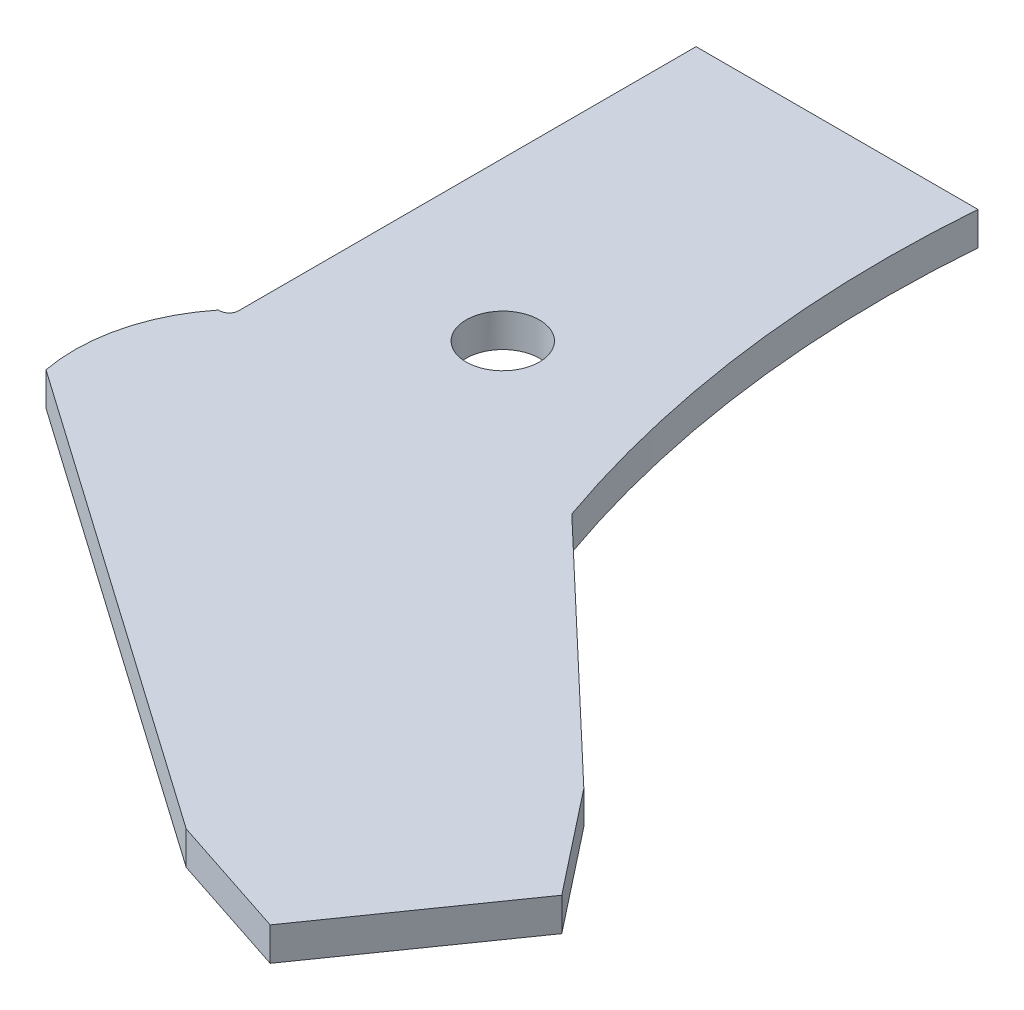
ISO-10303-21;
HEADER;
FILE_DESCRIPTION(('STEP AP214'),'2;1');
FILE_NAME('part.step','',(''),(''),'','','');
FILE_SCHEMA(('AUTOMOTIVE_DESIGN { 1 0 10303 214 1 1 1 1 }'));
ENDSEC;
DATA;
#1=APPLICATION_CONTEXT('core data for automotive mechanical design processes');
#2=APPLICATION_PROTOCOL_DEFINITION('international standard','automotive_design',2000,#1);
#3=PRODUCT_CONTEXT('',#1,'mechanical');
#4=PRODUCT('Part','Part','',(#3));
#5=PRODUCT_RELATED_PRODUCT_CATEGORY('part','',(#4));
#6=PRODUCT_DEFINITION_FORMATION('','',#4);
#7=PRODUCT_DEFINITION_CONTEXT('part definition',#1,'design');
#8=PRODUCT_DEFINITION('design','',#6,#7);
#9=PRODUCT_DEFINITION_SHAPE('','',#8);
#10=(LENGTH_UNIT() NAMED_UNIT(*) SI_UNIT(.MILLI.,.METRE.));
#11=(NAMED_UNIT(*) PLANE_ANGLE_UNIT() SI_UNIT($,.RADIAN.));
#12=(NAMED_UNIT(*) SI_UNIT($,.STERADIAN.) SOLID_ANGLE_UNIT());
#13=UNCERTAINTY_MEASURE_WITH_UNIT(LENGTH_MEASURE(1.E-05),#10,'distance_accuracy_value','');
#14=(GEOMETRIC_REPRESENTATION_CONTEXT(3) GLOBAL_UNCERTAINTY_ASSIGNED_CONTEXT((#13)) GLOBAL_UNIT_ASSIGNED_CONTEXT((#10,
#11,#12)) REPRESENTATION_CONTEXT('',''));
#15=CARTESIAN_POINT('',(0.,0.,0.));
#16=DIRECTION('',(0.,0.,1.));
#17=DIRECTION('',(1.,0.,0.));
#18=AXIS2_PLACEMENT_3D('',#15,#16,#17);
#19=CARTESIAN_POINT('',(-50.2046875,11.1125,152.5984375));
#20=DIRECTION('',(0.,-1.,0.));
#21=DIRECTION('',(0.,0.,-1.));
#22=AXIS2_PLACEMENT_3D('',#19,#20,#21);
#23=PLANE('',#22);
#24=CARTESIAN_POINT('',(5.75468750000002,11.1125,117.2765625));
#25=DIRECTION('',(0.,1.,0.));
#26=DIRECTION('',(0.,0.,1.));
#27=AXIS2_PLACEMENT_3D('',#24,#25,#26);
#28=CIRCLE('',#27,12.20390625);
#29=CARTESIAN_POINT('',(5.75468750000002,11.1125,129.48046875));
#30=VERTEX_POINT('',#29);
#31=EDGE_CURVE('E249',#30,#30,#28,.T.);
#32=ORIENTED_EDGE('',*,*,#31,.F.);
#33=EDGE_LOOP('',(#32));
#34=FACE_BOUND('',#33,.T.);
#35=DIRECTION('',(0.,0.,1.));
#36=VECTOR('',#35,1.);
#37=CARTESIAN_POINT('',(-47.0296875,11.1125,0.));
#38=LINE('',#37,#36);
#39=CARTESIAN_POINT('',(-47.0296875,11.1125,0.));
#40=VERTEX_POINT('',#39);
#41=CARTESIAN_POINT('',(-47.0296875,11.1125,152.5984375));
#42=VERTEX_POINT('',#41);
#43=EDGE_CURVE('E167',#40,#42,#38,.T.);
#44=ORIENTED_EDGE('',*,*,#43,.T.);
#45=CARTESIAN_POINT('',(-50.2046875,11.1125,152.5984375));
#46=DIRECTION('',(0.,-1.,0.));
#47=DIRECTION('',(0.,0.,-1.));
#48=AXIS2_PLACEMENT_3D('',#45,#46,#47);
#49=CIRCLE('',#48,3.17499999999999);
#50=CARTESIAN_POINT('',(-50.2046875,11.1125,155.7734375));
#51=VERTEX_POINT('',#50);
#52=EDGE_CURVE('E101',#42,#51,#49,.T.);
#53=ORIENTED_EDGE('',*,*,#52,.T.);
#54=DIRECTION('',(-1.,0.,0.));
#55=VECTOR('',#54,1.);
#56=CARTESIAN_POINT('',(-50.6015625,11.1125,155.7734375));
#57=LINE('',#56,#55);
#58=CARTESIAN_POINT('',(-50.6015625,11.1125,155.7734375));
#59=VERTEX_POINT('',#58);
#60=EDGE_CURVE('E191',#51,#59,#57,.T.);
#61=ORIENTED_EDGE('',*,*,#60,.T.);
#62=CARTESIAN_POINT('',(-6.35000000000003,11.1125,191.29375));
#63=DIRECTION('',(0.,1.,0.));
#64=DIRECTION('',(0.,0.,-1.));
#65=AXIS2_PLACEMENT_3D('',#62,#63,#64);
#66=CIRCLE('',#65,56.7441043967482);
#67=CARTESIAN_POINT('',(-62.1109375,11.1125,201.8109375));
#68=VERTEX_POINT('',#67);
#69=EDGE_CURVE('E209',#59,#68,#66,.T.);
#70=ORIENTED_EDGE('',*,*,#69,.T.);
#71=DIRECTION('',(0.819152044288994,0.,0.573576436351042));
#72=VECTOR('',#71,1.);
#73=CARTESIAN_POINT('',(-62.1109375,11.1125,201.8109375));
#74=LINE('',#73,#72);
#75=CARTESIAN_POINT('',(93.9375269370535,11.1125,311.077248624874));
#76=VERTEX_POINT('',#75);
#77=EDGE_CURVE('E206',#68,#76,#74,.T.);
#78=ORIENTED_EDGE('',*,*,#77,.T.);
#79=DIRECTION('',(0.949963175276949,0.,0.312361914480201));
#80=VECTOR('',#79,1.);
#81=CARTESIAN_POINT('',(93.9375269370535,11.1125,311.077248624874));
#82=LINE('',#81,#80);
#83=CARTESIAN_POINT('',(135.682650241894,11.1125,324.803661369147));
#84=VERTEX_POINT('',#83);
#85=EDGE_CURVE('E208',#76,#84,#82,.T.);
#86=ORIENTED_EDGE('',*,*,#85,.T.);
#87=DIRECTION('',(0.573576436351061,0.,-0.819152044288981));
#88=VECTOR('',#87,1.);
#89=CARTESIAN_POINT('',(135.682650241894,11.1125,324.803661369147));
#90=LINE('',#89,#88);
#91=CARTESIAN_POINT('',(175.746964321015,11.1125,267.585891075562));
#92=VERTEX_POINT('',#91);
#93=EDGE_CURVE('E211',#84,#92,#90,.T.);
#94=ORIENTED_EDGE('',*,*,#93,.T.);
#95=DIRECTION('',(-0.618430727413905,0.,-0.785839319066124));
#96=VECTOR('',#95,1.);
#97=CARTESIAN_POINT('',(175.746964321015,11.1125,267.585891075562));
#98=LINE('',#97,#96);
#99=CARTESIAN_POINT('',(148.570682499492,11.1125,233.053016406348));
#100=VERTEX_POINT('',#99);
#101=EDGE_CURVE('E128',#92,#100,#98,.T.);
#102=ORIENTED_EDGE('',*,*,#101,.T.);
#103=DIRECTION('',(-0.724802516724885,0.,-0.688956683507224));
#104=VECTOR('',#103,1.);
#105=CARTESIAN_POINT('',(67.2703125,11.1125,155.7734375));
#106=LINE('',#105,#104);
#107=CARTESIAN_POINT('',(67.2703124999999,11.1125,155.7734375));
#108=VERTEX_POINT('',#107);
#109=EDGE_CURVE('E123',#100,#108,#106,.T.);
#110=ORIENTED_EDGE('',*,*,#109,.T.);
#111=CARTESIAN_POINT('',(425.270240042471,11.1125,30.0545346935261));
#112=DIRECTION('',(0.,-1.,0.));
#113=DIRECTION('',(0.,0.,1.));
#114=AXIS2_PLACEMENT_3D('',#111,#112,#113);
#115=CIRCLE('',#114,379.432722156745);
#116=CARTESIAN_POINT('',(47.0296875,11.1125,0.));
#117=VERTEX_POINT('',#116);
#118=EDGE_CURVE('E126',#108,#117,#115,.T.);
#119=ORIENTED_EDGE('',*,*,#118,.T.);
#120=DIRECTION('',(-1.,0.,0.));
#121=VECTOR('',#120,1.);
#122=CARTESIAN_POINT('',(47.0296875,11.1125,0.));
#123=LINE('',#122,#121);
#124=EDGE_CURVE('E49',#117,#40,#123,.T.);
#125=ORIENTED_EDGE('',*,*,#124,.T.);
#126=EDGE_LOOP('',(#44,#53,#61,#70,#78,#86,#94,#102,#110,#119,#125));
#127=FACE_BOUND('',#126,.T.);
#128=ADVANCED_FACE('F32',(#34,#127),#23,.F.);
#129=CARTESIAN_POINT('',(-50.2046875,0.,152.5984375));
#130=DIRECTION('',(0.,-1.,0.));
#131=DIRECTION('',(0.,0.,-1.));
#132=AXIS2_PLACEMENT_3D('',#129,#130,#131);
#133=PLANE('',#132);
#134=CARTESIAN_POINT('',(5.75468750000002,0.,117.2765625));
#135=DIRECTION('',(0.,-1.,0.));
#136=DIRECTION('',(0.,0.,-1.));
#137=AXIS2_PLACEMENT_3D('',#134,#135,#136);
#138=CIRCLE('',#137,12.20390625);
#139=CARTESIAN_POINT('',(5.75468750000002,0.,105.07265625));
#140=VERTEX_POINT('',#139);
#141=EDGE_CURVE('E150',#140,#140,#138,.F.);
#142=ORIENTED_EDGE('',*,*,#141,.T.);
#143=EDGE_LOOP('',(#142));
#144=FACE_BOUND('',#143,.T.);
#145=DIRECTION('',(0.,0.,1.));
#146=VECTOR('',#145,1.);
#147=CARTESIAN_POINT('',(-47.0296875,0.,0.));
#148=LINE('',#147,#146);
#149=CARTESIAN_POINT('',(-47.0296875,0.,0.));
#150=VERTEX_POINT('',#149);
#151=CARTESIAN_POINT('',(-47.0296875,0.,152.5984375));
#152=VERTEX_POINT('',#151);
#153=EDGE_CURVE('E146',#150,#152,#148,.T.);
#154=ORIENTED_EDGE('',*,*,#153,.F.);
#155=DIRECTION('',(-1.,0.,0.));
#156=VECTOR('',#155,1.);
#157=CARTESIAN_POINT('',(47.0296875,0.,0.));
#158=LINE('',#157,#156);
#159=CARTESIAN_POINT('',(47.0296875,0.,0.));
#160=VERTEX_POINT('',#159);
#161=EDGE_CURVE('E93',#160,#150,#158,.T.);
#162=ORIENTED_EDGE('',*,*,#161,.F.);
#163=CARTESIAN_POINT('',(425.270240042471,0.,30.0545346935261));
#164=DIRECTION('',(0.,-1.,0.));
#165=DIRECTION('',(0.,0.,1.));
#166=AXIS2_PLACEMENT_3D('',#163,#164,#165);
#167=CIRCLE('',#166,379.432722156745);
#168=CARTESIAN_POINT('',(67.2703124999999,0.,155.7734375));
#169=VERTEX_POINT('',#168);
#170=EDGE_CURVE('E87',#169,#160,#167,.T.);
#171=ORIENTED_EDGE('',*,*,#170,.F.);
#172=DIRECTION('',(-0.724802516724885,0.,-0.688956683507224));
#173=VECTOR('',#172,1.);
#174=CARTESIAN_POINT('',(67.2703125,0.,155.7734375));
#175=LINE('',#174,#173);
#176=CARTESIAN_POINT('',(148.570682499492,0.,233.053016406348));
#177=VERTEX_POINT('',#176);
#178=EDGE_CURVE('E136',#177,#169,#175,.T.);
#179=ORIENTED_EDGE('',*,*,#178,.F.);
#180=DIRECTION('',(-0.618430727413905,0.,-0.785839319066124));
#181=VECTOR('',#180,1.);
#182=CARTESIAN_POINT('',(175.746964321015,0.,267.585891075562));
#183=LINE('',#182,#181);
#184=CARTESIAN_POINT('',(175.746964321015,0.,267.585891075562));
#185=VERTEX_POINT('',#184);
#186=EDGE_CURVE('E162',#185,#177,#183,.T.);
#187=ORIENTED_EDGE('',*,*,#186,.F.);
#188=DIRECTION('',(0.573576436351061,0.,-0.819152044288981));
#189=VECTOR('',#188,1.);
#190=CARTESIAN_POINT('',(135.682650241894,0.,324.803661369147));
#191=LINE('',#190,#189);
#192=CARTESIAN_POINT('',(135.682650241894,0.,324.803661369147));
#193=VERTEX_POINT('',#192);
#194=EDGE_CURVE('E160',#193,#185,#191,.T.);
#195=ORIENTED_EDGE('',*,*,#194,.F.);
#196=DIRECTION('',(0.949963175276949,0.,0.312361914480201));
#197=VECTOR('',#196,1.);
#198=CARTESIAN_POINT('',(93.9375269370535,0.,311.077248624874));
#199=LINE('',#198,#197);
#200=CARTESIAN_POINT('',(93.9375269370535,0.,311.077248624874));
#201=VERTEX_POINT('',#200);
#202=EDGE_CURVE('E158',#201,#193,#199,.T.);
#203=ORIENTED_EDGE('',*,*,#202,.F.);
#204=DIRECTION('',(0.819152044288994,0.,0.573576436351042));
#205=VECTOR('',#204,1.);
#206=CARTESIAN_POINT('',(-62.1109375,0.,201.8109375));
#207=LINE('',#206,#205);
#208=CARTESIAN_POINT('',(-62.1109375,0.,201.8109375));
#209=VERTEX_POINT('',#208);
#210=EDGE_CURVE('E156',#209,#201,#207,.T.);
#211=ORIENTED_EDGE('',*,*,#210,.F.);
#212=CARTESIAN_POINT('',(-6.35000000000003,0.,191.29375));
#213=DIRECTION('',(0.,1.,0.));
#214=DIRECTION('',(0.,0.,-1.));
#215=AXIS2_PLACEMENT_3D('',#212,#213,#214);
#216=CIRCLE('',#215,56.7441043967482);
#217=CARTESIAN_POINT('',(-50.6015625,0.,155.7734375));
#218=VERTEX_POINT('',#217);
#219=EDGE_CURVE('E154',#218,#209,#216,.T.);
#220=ORIENTED_EDGE('',*,*,#219,.F.);
#221=DIRECTION('',(-1.,0.,0.));
#222=VECTOR('',#221,1.);
#223=CARTESIAN_POINT('',(-50.6015625,0.,155.7734375));
#224=LINE('',#223,#222);
#225=CARTESIAN_POINT('',(-50.2046875,0.,155.7734375));
#226=VERTEX_POINT('',#225);
#227=EDGE_CURVE('E152',#226,#218,#224,.T.);
#228=ORIENTED_EDGE('',*,*,#227,.F.);
#229=CARTESIAN_POINT('',(-50.2046875,0.,152.5984375));
#230=DIRECTION('',(0.,-1.,0.));
#231=DIRECTION('',(0.,0.,-1.));
#232=AXIS2_PLACEMENT_3D('',#229,#230,#231);
#233=CIRCLE('',#232,3.17499999999999);
#234=EDGE_CURVE('E149',#152,#226,#233,.T.);
#235=ORIENTED_EDGE('',*,*,#234,.F.);
#236=EDGE_LOOP('',(#154,#162,#171,#179,#187,#195,#203,#211,#220,#228,#235));
#237=FACE_BOUND('',#236,.T.);
#238=ADVANCED_FACE('F195',(#144,#237),#133,.T.);
#239=CARTESIAN_POINT('',(-47.0296875,11.1125,0.));
#240=DIRECTION('',(1.,0.,0.));
#241=DIRECTION('',(0.,0.,-1.));
#242=AXIS2_PLACEMENT_3D('',#239,#240,#241);
#243=PLANE('',#242);
#244=ORIENTED_EDGE('',*,*,#153,.T.);
#245=DIRECTION('',(0.,-1.,0.));
#246=VECTOR('',#245,1.);
#247=CARTESIAN_POINT('',(-47.0296875,11.1125,152.5984375));
#248=LINE('',#247,#246);
#249=EDGE_CURVE('E11',#42,#152,#248,.T.);
#250=ORIENTED_EDGE('',*,*,#249,.F.);
#251=ORIENTED_EDGE('',*,*,#43,.F.);
#252=DIRECTION('',(0.,-1.,0.));
#253=VECTOR('',#252,1.);
#254=CARTESIAN_POINT('',(-47.0296875,11.1125,0.));
#255=LINE('',#254,#253);
#256=EDGE_CURVE('E142',#40,#150,#255,.T.);
#257=ORIENTED_EDGE('',*,*,#256,.T.);
#258=EDGE_LOOP('',(#244,#250,#251,#257));
#259=FACE_BOUND('',#258,.T.);
#260=ADVANCED_FACE('F34',(#259),#243,.F.);
#261=CARTESIAN_POINT('',(-50.2046875,11.1125,152.5984375));
#262=DIRECTION('',(0.,-1.,0.));
#263=DIRECTION('',(0.,0.,-1.));
#264=AXIS2_PLACEMENT_3D('',#261,#262,#263);
#265=CYLINDRICAL_SURFACE('',#264,3.17499999999999);
#266=ORIENTED_EDGE('',*,*,#234,.T.);
#267=DIRECTION('',(0.,-1.,0.));
#268=VECTOR('',#267,1.);
#269=CARTESIAN_POINT('',(-50.2046875,11.1125,155.7734375));
#270=LINE('',#269,#268);
#271=EDGE_CURVE('E41',#51,#226,#270,.T.);
#272=ORIENTED_EDGE('',*,*,#271,.F.);
#273=ORIENTED_EDGE('',*,*,#52,.F.);
#274=ORIENTED_EDGE('',*,*,#249,.T.);
#275=EDGE_LOOP('',(#266,#272,#273,#274));
#276=FACE_BOUND('',#275,.T.);
#277=ADVANCED_FACE('F260',(#276),#265,.F.);
#278=CARTESIAN_POINT('',(-50.6015625,11.1125,155.7734375));
#279=DIRECTION('',(0.,0.,1.));
#280=DIRECTION('',(1.,0.,0.));
#281=AXIS2_PLACEMENT_3D('',#278,#279,#280);
#282=PLANE('',#281);
#283=ORIENTED_EDGE('',*,*,#227,.T.);
#284=DIRECTION('',(0.,-1.,0.));
#285=VECTOR('',#284,1.);
#286=CARTESIAN_POINT('',(-50.6015625,11.1125,155.7734375));
#287=LINE('',#286,#285);
#288=EDGE_CURVE('E183',#59,#218,#287,.T.);
#289=ORIENTED_EDGE('',*,*,#288,.F.);
#290=ORIENTED_EDGE('',*,*,#60,.F.);
#291=ORIENTED_EDGE('',*,*,#271,.T.);
#292=EDGE_LOOP('',(#283,#289,#290,#291));
#293=FACE_BOUND('',#292,.T.);
#294=ADVANCED_FACE('F189',(#293),#282,.F.);
#295=CARTESIAN_POINT('',(-6.35000000000003,11.1125,191.29375));
#296=DIRECTION('',(0.,-1.,0.));
#297=DIRECTION('',(0.,0.,-1.));
#298=AXIS2_PLACEMENT_3D('',#295,#296,#297);
#299=CYLINDRICAL_SURFACE('',#298,56.7441043967482);
#300=ORIENTED_EDGE('',*,*,#219,.T.);
#301=DIRECTION('',(0.,-1.,0.));
#302=VECTOR('',#301,1.);
#303=CARTESIAN_POINT('',(-62.1109375,11.1125,201.8109375));
#304=LINE('',#303,#302);
#305=EDGE_CURVE('E180',#68,#209,#304,.T.);
#306=ORIENTED_EDGE('',*,*,#305,.F.);
#307=ORIENTED_EDGE('',*,*,#69,.F.);
#308=ORIENTED_EDGE('',*,*,#288,.T.);
#309=EDGE_LOOP('',(#300,#306,#307,#308));
#310=FACE_BOUND('',#309,.T.);
#311=ADVANCED_FACE('F200',(#310),#299,.T.);
#312=CARTESIAN_POINT('',(-62.1109375,11.1125,201.8109375));
#313=DIRECTION('',(0.573576436351042,0.,-0.819152044288994));
#314=DIRECTION('',(-0.819152044288994,0.,-0.573576436351042));
#315=AXIS2_PLACEMENT_3D('',#312,#313,#314);
#316=PLANE('',#315);
#317=ORIENTED_EDGE('',*,*,#210,.T.);
#318=DIRECTION('',(0.,-1.,0.));
#319=VECTOR('',#318,1.);
#320=CARTESIAN_POINT('',(93.9375269370535,11.1125,311.077248624874));
#321=LINE('',#320,#319);
#322=EDGE_CURVE('E177',#76,#201,#321,.T.);
#323=ORIENTED_EDGE('',*,*,#322,.F.);
#324=ORIENTED_EDGE('',*,*,#77,.F.);
#325=ORIENTED_EDGE('',*,*,#305,.T.);
#326=EDGE_LOOP('',(#317,#323,#324,#325));
#327=FACE_BOUND('',#326,.T.);
#328=ADVANCED_FACE('F204',(#327),#316,.F.);
#329=CARTESIAN_POINT('',(93.9375269370535,11.1125,311.077248624874));
#330=DIRECTION('',(0.3123619144802,0.,-0.949963175276949));
#331=DIRECTION('',(-0.949963175276949,0.,-0.3123619144802));
#332=AXIS2_PLACEMENT_3D('',#329,#330,#331);
#333=PLANE('',#332);
#334=ORIENTED_EDGE('',*,*,#202,.T.);
#335=DIRECTION('',(0.,-1.,0.));
#336=VECTOR('',#335,1.);
#337=CARTESIAN_POINT('',(135.682650241894,11.1125,324.803661369147));
#338=LINE('',#337,#336);
#339=EDGE_CURVE('E174',#84,#193,#338,.T.);
#340=ORIENTED_EDGE('',*,*,#339,.F.);
#341=ORIENTED_EDGE('',*,*,#85,.F.);
#342=ORIENTED_EDGE('',*,*,#322,.T.);
#343=EDGE_LOOP('',(#334,#340,#341,#342));
#344=FACE_BOUND('',#343,.T.);
#345=ADVANCED_FACE('F273',(#344),#333,.F.);
#346=CARTESIAN_POINT('',(135.682650241894,11.1125,324.803661369147));
#347=DIRECTION('',(-0.819152044288981,0.,-0.573576436351061));
#348=DIRECTION('',(-0.573576436351061,0.,0.819152044288981));
#349=AXIS2_PLACEMENT_3D('',#346,#347,#348);
#350=PLANE('',#349);
#351=ORIENTED_EDGE('',*,*,#194,.T.);
#352=DIRECTION('',(0.,-1.,0.));
#353=VECTOR('',#352,1.);
#354=CARTESIAN_POINT('',(175.746964321015,11.1125,267.585891075562));
#355=LINE('',#354,#353);
#356=EDGE_CURVE('E171',#92,#185,#355,.T.);
#357=ORIENTED_EDGE('',*,*,#356,.F.);
#358=ORIENTED_EDGE('',*,*,#93,.F.);
#359=ORIENTED_EDGE('',*,*,#339,.T.);
#360=EDGE_LOOP('',(#351,#357,#358,#359));
#361=FACE_BOUND('',#360,.T.);
#362=ADVANCED_FACE('F220',(#361),#350,.F.);
#363=CARTESIAN_POINT('',(175.746964321015,11.1125,267.585891075562));
#364=DIRECTION('',(-0.785839319066124,0.,0.618430727413905));
#365=DIRECTION('',(0.618430727413905,0.,0.785839319066124));
#366=AXIS2_PLACEMENT_3D('',#363,#364,#365);
#367=PLANE('',#366);
#368=ORIENTED_EDGE('',*,*,#186,.T.);
#369=DIRECTION('',(0.,-1.,0.));
#370=VECTOR('',#369,1.);
#371=CARTESIAN_POINT('',(148.570682499492,11.1125,233.053016406348));
#372=LINE('',#371,#370);
#373=EDGE_CURVE('E137',#100,#177,#372,.T.);
#374=ORIENTED_EDGE('',*,*,#373,.F.);
#375=ORIENTED_EDGE('',*,*,#101,.F.);
#376=ORIENTED_EDGE('',*,*,#356,.T.);
#377=EDGE_LOOP('',(#368,#374,#375,#376));
#378=FACE_BOUND('',#377,.T.);
#379=ADVANCED_FACE('F224',(#378),#367,.F.);
#380=CARTESIAN_POINT('',(67.2703125,11.1125,155.7734375));
#381=DIRECTION('',(-0.688956683507224,0.,0.724802516724884));
#382=DIRECTION('',(0.724802516724884,0.,0.688956683507224));
#383=AXIS2_PLACEMENT_3D('',#380,#381,#382);
#384=PLANE('',#383);
#385=ORIENTED_EDGE('',*,*,#178,.T.);
#386=DIRECTION('',(0.,-1.,0.));
#387=VECTOR('',#386,1.);
#388=CARTESIAN_POINT('',(67.2703124999999,11.1125,155.7734375));
#389=LINE('',#388,#387);
#390=EDGE_CURVE('E133',#108,#169,#389,.T.);
#391=ORIENTED_EDGE('',*,*,#390,.F.);
#392=ORIENTED_EDGE('',*,*,#109,.F.);
#393=ORIENTED_EDGE('',*,*,#373,.T.);
#394=EDGE_LOOP('',(#385,#391,#392,#393));
#395=FACE_BOUND('',#394,.T.);
#396=ADVANCED_FACE('F134',(#395),#384,.F.);
#397=CARTESIAN_POINT('',(425.270240042471,11.1125,30.0545346935261));
#398=DIRECTION('',(0.,-1.,0.));
#399=DIRECTION('',(0.,0.,-1.));
#400=AXIS2_PLACEMENT_3D('',#397,#398,#399);
#401=CYLINDRICAL_SURFACE('',#400,379.432722156745);
#402=ORIENTED_EDGE('',*,*,#170,.T.);
#403=DIRECTION('',(0.,-1.,0.));
#404=VECTOR('',#403,1.);
#405=CARTESIAN_POINT('',(47.0296875,11.1125,0.));
#406=LINE('',#405,#404);
#407=EDGE_CURVE('E138',#117,#160,#406,.T.);
#408=ORIENTED_EDGE('',*,*,#407,.F.);
#409=ORIENTED_EDGE('',*,*,#118,.F.);
#410=ORIENTED_EDGE('',*,*,#390,.T.);
#411=EDGE_LOOP('',(#402,#408,#409,#410));
#412=FACE_BOUND('',#411,.T.);
#413=ADVANCED_FACE('F140',(#412),#401,.F.);
#414=CARTESIAN_POINT('',(47.0296875,11.1125,0.));
#415=DIRECTION('',(0.,0.,1.));
#416=DIRECTION('',(1.,0.,0.));
#417=AXIS2_PLACEMENT_3D('',#414,#415,#416);
#418=PLANE('',#417);
#419=ORIENTED_EDGE('',*,*,#161,.T.);
#420=ORIENTED_EDGE('',*,*,#256,.F.);
#421=ORIENTED_EDGE('',*,*,#124,.F.);
#422=ORIENTED_EDGE('',*,*,#407,.T.);
#423=EDGE_LOOP('',(#419,#420,#421,#422));
#424=FACE_BOUND('',#423,.T.);
#425=ADVANCED_FACE('F228',(#424),#418,.F.);
#426=CARTESIAN_POINT('',(5.75468750000002,-34.5178594653596,117.2765625));
#427=DIRECTION('',(0.,1.,0.));
#428=DIRECTION('',(0.,0.,1.));
#429=AXIS2_PLACEMENT_3D('',#426,#427,#428);
#430=CYLINDRICAL_SURFACE('',#429,12.20390625);
#431=ORIENTED_EDGE('',*,*,#31,.T.);
#432=EDGE_LOOP('',(#431));
#433=FACE_BOUND('',#432,.T.);
#434=ORIENTED_EDGE('',*,*,#141,.F.);
#435=EDGE_LOOP('',(#434));
#436=FACE_BOUND('',#435,.T.);
#437=ADVANCED_FACE('F230',(#433,#436),#430,.F.);
#438=CLOSED_SHELL('',(#128,#238,#260,#277,#294,#311,#328,#345,#362,#379,#396,#413,#425,#437));
#439=MANIFOLD_SOLID_BREP('B2',#438);
#440=ADVANCED_BREP_SHAPE_REPRESENTATION('',(#18,#439),#14);
#441=SHAPE_DEFINITION_REPRESENTATION(#9,#440);
ENDSEC;
END-ISO-10303-21;
